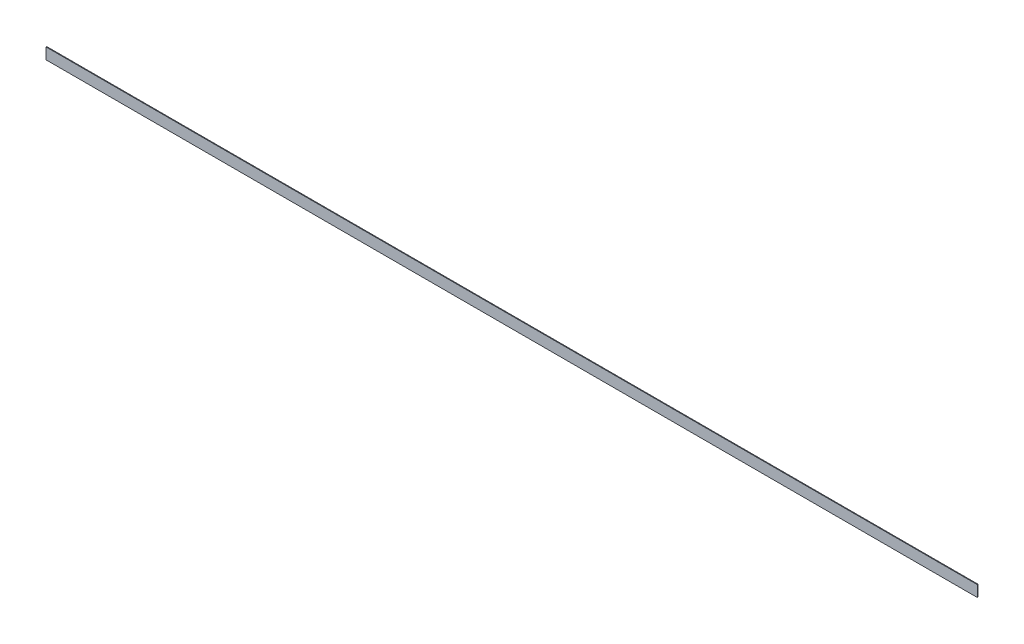
ISO-10303-21;
HEADER;
FILE_DESCRIPTION(('STEP AP214'),'2;1');
FILE_NAME('part.step','',(''),(''),'','','');
FILE_SCHEMA(('AUTOMOTIVE_DESIGN { 1 0 10303 214 1 1 1 1 }'));
ENDSEC;
DATA;
#1=APPLICATION_CONTEXT('core data for automotive mechanical design processes');
#2=APPLICATION_PROTOCOL_DEFINITION('international standard','automotive_design',2000,#1);
#3=PRODUCT_CONTEXT('',#1,'mechanical');
#4=PRODUCT('Part','Part','',(#3));
#5=PRODUCT_RELATED_PRODUCT_CATEGORY('part','',(#4));
#6=PRODUCT_DEFINITION_FORMATION('','',#4);
#7=PRODUCT_DEFINITION_CONTEXT('part definition',#1,'design');
#8=PRODUCT_DEFINITION('design','',#6,#7);
#9=PRODUCT_DEFINITION_SHAPE('','',#8);
#10=(LENGTH_UNIT() NAMED_UNIT(*) SI_UNIT(.MILLI.,.METRE.));
#11=(NAMED_UNIT(*) PLANE_ANGLE_UNIT() SI_UNIT($,.RADIAN.));
#12=(NAMED_UNIT(*) SI_UNIT($,.STERADIAN.) SOLID_ANGLE_UNIT());
#13=UNCERTAINTY_MEASURE_WITH_UNIT(LENGTH_MEASURE(1.E-05),#10,'distance_accuracy_value','');
#14=(GEOMETRIC_REPRESENTATION_CONTEXT(3) GLOBAL_UNCERTAINTY_ASSIGNED_CONTEXT((#13)) GLOBAL_UNIT_ASSIGNED_CONTEXT((#10,
#11,#12)) REPRESENTATION_CONTEXT('',''));
#15=CARTESIAN_POINT('',(0.,0.,0.));
#16=DIRECTION('',(0.,0.,1.));
#17=DIRECTION('',(1.,0.,0.));
#18=AXIS2_PLACEMENT_3D('',#15,#16,#17);
#19=CARTESIAN_POINT('',(-2114.55,-25.4,-3.175));
#20=DIRECTION('',(0.,0.,-1.));
#21=DIRECTION('',(-1.,0.,0.));
#22=AXIS2_PLACEMENT_3D('',#19,#20,#21);
#23=PLANE('',#22);
#24=DIRECTION('',(1.,0.,0.));
#25=VECTOR('',#24,1.);
#26=CARTESIAN_POINT('',(-2114.55,-25.4,-3.175));
#27=LINE('',#26,#25);
#28=CARTESIAN_POINT('',(-2114.55,-25.4,-3.175));
#29=VERTEX_POINT('',#28);
#30=CARTESIAN_POINT('',(2114.55,-25.4,-3.175));
#31=VERTEX_POINT('',#30);
#32=EDGE_CURVE('E20',#29,#31,#27,.T.);
#33=ORIENTED_EDGE('',*,*,#32,.F.);
#34=DIRECTION('',(0.,1.,0.));
#35=VECTOR('',#34,1.);
#36=CARTESIAN_POINT('',(-2114.55,0.,-3.175));
#37=LINE('',#36,#35);
#38=CARTESIAN_POINT('',(-2114.55,25.4,-3.175));
#39=VERTEX_POINT('',#38);
#40=EDGE_CURVE('E80',#29,#39,#37,.T.);
#41=ORIENTED_EDGE('',*,*,#40,.T.);
#42=DIRECTION('',(1.,0.,0.));
#43=VECTOR('',#42,1.);
#44=CARTESIAN_POINT('',(-2114.55,25.4,-3.175));
#45=LINE('',#44,#43);
#46=CARTESIAN_POINT('',(2114.55,25.4,-3.175));
#47=VERTEX_POINT('',#46);
#48=EDGE_CURVE('E68',#47,#39,#45,.F.);
#49=ORIENTED_EDGE('',*,*,#48,.F.);
#50=DIRECTION('',(0.,1.,0.));
#51=VECTOR('',#50,1.);
#52=CARTESIAN_POINT('',(2114.55,0.,-3.175));
#53=LINE('',#52,#51);
#54=EDGE_CURVE('E56',#31,#47,#53,.T.);
#55=ORIENTED_EDGE('',*,*,#54,.F.);
#56=EDGE_LOOP('',(#33,#41,#49,#55));
#57=FACE_BOUND('',#56,.T.);
#58=ADVANCED_FACE('F17',(#57),#23,.T.);
#59=CARTESIAN_POINT('',(-2114.55,-25.4,0.));
#60=DIRECTION('',(0.,-1.,0.));
#61=DIRECTION('',(0.,0.,-1.));
#62=AXIS2_PLACEMENT_3D('',#59,#60,#61);
#63=PLANE('',#62);
#64=DIRECTION('',(1.,0.,0.));
#65=VECTOR('',#64,1.);
#66=CARTESIAN_POINT('',(-2114.55,-25.4,0.));
#67=LINE('',#66,#65);
#68=CARTESIAN_POINT('',(-2114.55,-25.4,0.));
#69=VERTEX_POINT('',#68);
#70=CARTESIAN_POINT('',(2114.55,-25.4,0.));
#71=VERTEX_POINT('',#70);
#72=EDGE_CURVE('E83',#69,#71,#67,.T.);
#73=ORIENTED_EDGE('',*,*,#72,.F.);
#74=DIRECTION('',(0.,0.,-1.));
#75=VECTOR('',#74,1.);
#76=CARTESIAN_POINT('',(-2114.55,-25.4,0.));
#77=LINE('',#76,#75);
#78=EDGE_CURVE('E65',#69,#29,#77,.T.);
#79=ORIENTED_EDGE('',*,*,#78,.T.);
#80=ORIENTED_EDGE('',*,*,#32,.T.);
#81=DIRECTION('',(0.,0.,-1.));
#82=VECTOR('',#81,1.);
#83=CARTESIAN_POINT('',(2114.55,-25.4,0.));
#84=LINE('',#83,#82);
#85=EDGE_CURVE('E62',#71,#31,#84,.T.);
#86=ORIENTED_EDGE('',*,*,#85,.F.);
#87=EDGE_LOOP('',(#73,#79,#80,#86));
#88=FACE_BOUND('',#87,.T.);
#89=ADVANCED_FACE('F61',(#88),#63,.T.);
#90=CARTESIAN_POINT('',(2114.55,0.,0.));
#91=DIRECTION('',(1.,0.,0.));
#92=DIRECTION('',(0.,0.,-1.));
#93=AXIS2_PLACEMENT_3D('',#90,#91,#92);
#94=PLANE('',#93);
#95=DIRECTION('',(0.,0.,1.));
#96=VECTOR('',#95,1.);
#97=CARTESIAN_POINT('',(2114.55,25.4,-3.175));
#98=LINE('',#97,#96);
#99=CARTESIAN_POINT('',(2114.55,25.4,0.));
#100=VERTEX_POINT('',#99);
#101=EDGE_CURVE('E70',#100,#47,#98,.F.);
#102=ORIENTED_EDGE('',*,*,#101,.F.);
#103=DIRECTION('',(0.,1.,0.));
#104=VECTOR('',#103,1.);
#105=CARTESIAN_POINT('',(2114.55,25.4,0.));
#106=LINE('',#105,#104);
#107=EDGE_CURVE('E74',#71,#100,#106,.T.);
#108=ORIENTED_EDGE('',*,*,#107,.F.);
#109=ORIENTED_EDGE('',*,*,#85,.T.);
#110=ORIENTED_EDGE('',*,*,#54,.T.);
#111=EDGE_LOOP('',(#102,#108,#109,#110));
#112=FACE_BOUND('',#111,.T.);
#113=ADVANCED_FACE('F72',(#112),#94,.T.);
#114=CARTESIAN_POINT('',(-2114.55,25.4,-3.175));
#115=DIRECTION('',(0.,1.,0.));
#116=DIRECTION('',(0.,0.,1.));
#117=AXIS2_PLACEMENT_3D('',#114,#115,#116);
#118=PLANE('',#117);
#119=ORIENTED_EDGE('',*,*,#48,.T.);
#120=DIRECTION('',(0.,0.,-1.));
#121=VECTOR('',#120,1.);
#122=CARTESIAN_POINT('',(-2114.55,25.4,0.));
#123=LINE('',#122,#121);
#124=CARTESIAN_POINT('',(-2114.55,25.4,0.));
#125=VERTEX_POINT('',#124);
#126=EDGE_CURVE('E35',#39,#125,#123,.F.);
#127=ORIENTED_EDGE('',*,*,#126,.T.);
#128=DIRECTION('',(1.,0.,0.));
#129=VECTOR('',#128,1.);
#130=CARTESIAN_POINT('',(-2114.55,25.4,0.));
#131=LINE('',#130,#129);
#132=EDGE_CURVE('E26',#100,#125,#131,.F.);
#133=ORIENTED_EDGE('',*,*,#132,.F.);
#134=ORIENTED_EDGE('',*,*,#101,.T.);
#135=EDGE_LOOP('',(#119,#127,#133,#134));
#136=FACE_BOUND('',#135,.T.);
#137=ADVANCED_FACE('F89',(#136),#118,.T.);
#138=CARTESIAN_POINT('',(-2114.55,0.,0.));
#139=DIRECTION('',(1.,0.,0.));
#140=DIRECTION('',(0.,0.,-1.));
#141=AXIS2_PLACEMENT_3D('',#138,#139,#140);
#142=PLANE('',#141);
#143=ORIENTED_EDGE('',*,*,#40,.F.);
#144=ORIENTED_EDGE('',*,*,#78,.F.);
#145=DIRECTION('',(0.,1.,0.));
#146=VECTOR('',#145,1.);
#147=CARTESIAN_POINT('',(-2114.55,25.4,0.));
#148=LINE('',#147,#146);
#149=EDGE_CURVE('E11',#125,#69,#148,.F.);
#150=ORIENTED_EDGE('',*,*,#149,.F.);
#151=ORIENTED_EDGE('',*,*,#126,.F.);
#152=EDGE_LOOP('',(#143,#144,#150,#151));
#153=FACE_BOUND('',#152,.T.);
#154=ADVANCED_FACE('F91',(#153),#142,.F.);
#155=CARTESIAN_POINT('',(-2114.55,25.4,0.));
#156=DIRECTION('',(0.,0.,1.));
#157=DIRECTION('',(1.,0.,0.));
#158=AXIS2_PLACEMENT_3D('',#155,#156,#157);
#159=PLANE('',#158);
#160=ORIENTED_EDGE('',*,*,#132,.T.);
#161=ORIENTED_EDGE('',*,*,#149,.T.);
#162=ORIENTED_EDGE('',*,*,#72,.T.);
#163=ORIENTED_EDGE('',*,*,#107,.T.);
#164=EDGE_LOOP('',(#160,#161,#162,#163));
#165=FACE_BOUND('',#164,.T.);
#166=ADVANCED_FACE('F88',(#165),#159,.T.);
#167=CLOSED_SHELL('',(#58,#89,#113,#137,#154,#166));
#168=MANIFOLD_SOLID_BREP('B1',#167);
#169=ADVANCED_BREP_SHAPE_REPRESENTATION('',(#18,#168),#14);
#170=SHAPE_DEFINITION_REPRESENTATION(#9,#169);
ENDSEC;
END-ISO-10303-21;
